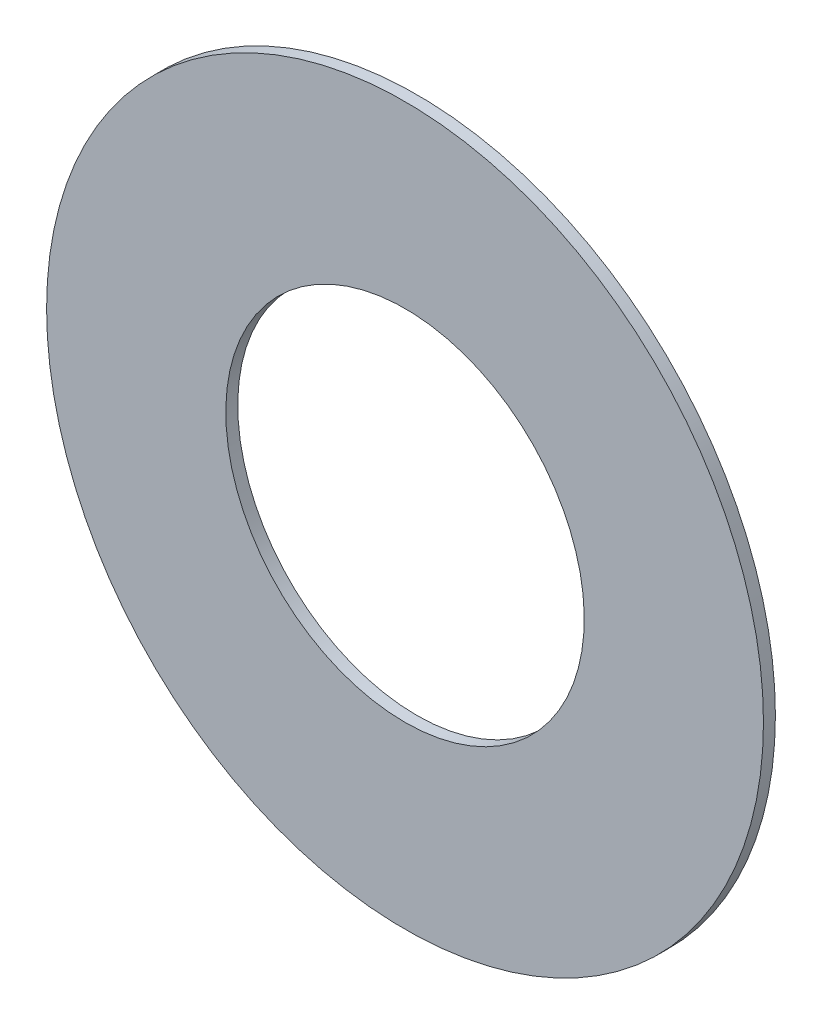
ISO-10303-21;
HEADER;
FILE_DESCRIPTION(('STEP AP214'),'2;1');
FILE_NAME('part.step','',(''),(''),'','','');
FILE_SCHEMA(('AUTOMOTIVE_DESIGN { 1 0 10303 214 1 1 1 1 }'));
ENDSEC;
DATA;
#1=APPLICATION_CONTEXT('core data for automotive mechanical design processes');
#2=APPLICATION_PROTOCOL_DEFINITION('international standard','automotive_design',2000,#1);
#3=PRODUCT_CONTEXT('',#1,'mechanical');
#4=PRODUCT('Part','Part','',(#3));
#5=PRODUCT_RELATED_PRODUCT_CATEGORY('part','',(#4));
#6=PRODUCT_DEFINITION_FORMATION('','',#4);
#7=PRODUCT_DEFINITION_CONTEXT('part definition',#1,'design');
#8=PRODUCT_DEFINITION('design','',#6,#7);
#9=PRODUCT_DEFINITION_SHAPE('','',#8);
#10=(LENGTH_UNIT() NAMED_UNIT(*) SI_UNIT(.MILLI.,.METRE.));
#11=(NAMED_UNIT(*) PLANE_ANGLE_UNIT() SI_UNIT($,.RADIAN.));
#12=(NAMED_UNIT(*) SI_UNIT($,.STERADIAN.) SOLID_ANGLE_UNIT());
#13=UNCERTAINTY_MEASURE_WITH_UNIT(LENGTH_MEASURE(1.E-05),#10,'distance_accuracy_value','');
#14=(GEOMETRIC_REPRESENTATION_CONTEXT(3) GLOBAL_UNCERTAINTY_ASSIGNED_CONTEXT((#13)) GLOBAL_UNIT_ASSIGNED_CONTEXT((#10,
#11,#12)) REPRESENTATION_CONTEXT('',''));
#15=CARTESIAN_POINT('',(0.,0.,0.));
#16=DIRECTION('',(0.,0.,1.));
#17=DIRECTION('',(1.,0.,0.));
#18=AXIS2_PLACEMENT_3D('',#15,#16,#17);
#19=CARTESIAN_POINT('',(126.802,-114.284,-0.045));
#20=DIRECTION('',(0.,0.,-1.));
#21=DIRECTION('',(0.,-1.,0.));
#22=AXIS2_PLACEMENT_3D('',#19,#20,#21);
#23=CYLINDRICAL_SURFACE('',#22,0.525);
#24=CARTESIAN_POINT('',(126.802,-114.284,1.67));
#25=DIRECTION('',(0.,0.,-1.));
#26=DIRECTION('',(0.,-1.,0.));
#27=AXIS2_PLACEMENT_3D('',#24,#25,#26);
#28=CIRCLE('',#27,0.525);
#29=CARTESIAN_POINT('',(126.802,-114.809,1.67));
#30=VERTEX_POINT('',#29);
#31=EDGE_CURVE('E26',#30,#30,#28,.T.);
#32=ORIENTED_EDGE('',*,*,#31,.T.);
#33=DIRECTION('',(0.,0.,1.));
#34=VECTOR('',#33,1.);
#35=CARTESIAN_POINT('',(126.802,-114.809,-0.045));
#36=LINE('',#35,#34);
#37=CARTESIAN_POINT('',(126.802,-114.809,1.705));
#38=VERTEX_POINT('',#37);
#39=EDGE_CURVE('E11',#30,#38,#36,.T.);
#40=ORIENTED_EDGE('',*,*,#39,.T.);
#41=CARTESIAN_POINT('',(126.802,-114.284,1.705));
#42=DIRECTION('',(0.,0.,-1.));
#43=DIRECTION('',(0.,-1.,0.));
#44=AXIS2_PLACEMENT_3D('',#41,#42,#43);
#45=CIRCLE('',#44,0.525);
#46=EDGE_CURVE('E70',#38,#38,#45,.T.);
#47=ORIENTED_EDGE('',*,*,#46,.F.);
#48=ORIENTED_EDGE('',*,*,#39,.F.);
#49=EDGE_LOOP('',(#32,#40,#47,#48));
#50=FACE_BOUND('',#49,.T.);
#51=ADVANCED_FACE('F17',(#50),#23,.F.);
#52=CARTESIAN_POINT('',(126.802,-114.284,1.67));
#53=DIRECTION('',(0.,0.,1.));
#54=DIRECTION('',(1.,0.,0.));
#55=AXIS2_PLACEMENT_3D('',#52,#53,#54);
#56=PLANE('',#55);
#57=ORIENTED_EDGE('',*,*,#31,.F.);
#58=EDGE_LOOP('',(#57));
#59=FACE_BOUND('',#58,.T.);
#60=CARTESIAN_POINT('',(126.802,-114.284,1.67));
#61=DIRECTION('',(0.,0.,1.));
#62=DIRECTION('',(1.,0.,0.));
#63=AXIS2_PLACEMENT_3D('',#60,#61,#62);
#64=CIRCLE('',#63,1.05);
#65=CARTESIAN_POINT('',(127.852,-114.284,1.67));
#66=VERTEX_POINT('',#65);
#67=EDGE_CURVE('E57',#66,#66,#64,.T.);
#68=ORIENTED_EDGE('',*,*,#67,.F.);
#69=EDGE_LOOP('',(#68));
#70=FACE_BOUND('',#69,.T.);
#71=ADVANCED_FACE('F19',(#59,#70),#56,.F.);
#72=CARTESIAN_POINT('',(126.802,-114.284,1.705));
#73=DIRECTION('',(0.,0.,1.));
#74=DIRECTION('',(1.,0.,0.));
#75=AXIS2_PLACEMENT_3D('',#72,#73,#74);
#76=PLANE('',#75);
#77=ORIENTED_EDGE('',*,*,#46,.T.);
#78=EDGE_LOOP('',(#77));
#79=FACE_BOUND('',#78,.T.);
#80=CARTESIAN_POINT('',(126.802,-114.284,1.705));
#81=DIRECTION('',(0.,0.,1.));
#82=DIRECTION('',(1.,0.,0.));
#83=AXIS2_PLACEMENT_3D('',#80,#81,#82);
#84=CIRCLE('',#83,1.05);
#85=CARTESIAN_POINT('',(127.852,-114.284,1.705));
#86=VERTEX_POINT('',#85);
#87=EDGE_CURVE('E55',#86,#86,#84,.T.);
#88=ORIENTED_EDGE('',*,*,#87,.T.);
#89=EDGE_LOOP('',(#88));
#90=FACE_BOUND('',#89,.T.);
#91=ADVANCED_FACE('F61',(#79,#90),#76,.T.);
#92=CARTESIAN_POINT('',(126.802,-114.284,1.67));
#93=DIRECTION('',(0.,0.,1.));
#94=DIRECTION('',(1.,0.,0.));
#95=AXIS2_PLACEMENT_3D('',#92,#93,#94);
#96=CYLINDRICAL_SURFACE('',#95,1.05);
#97=ORIENTED_EDGE('',*,*,#87,.F.);
#98=DIRECTION('',(0.,0.,1.));
#99=VECTOR('',#98,1.);
#100=CARTESIAN_POINT('',(127.852,-114.284,1.67));
#101=LINE('',#100,#99);
#102=EDGE_CURVE('E52',#66,#86,#101,.T.);
#103=ORIENTED_EDGE('',*,*,#102,.F.);
#104=ORIENTED_EDGE('',*,*,#67,.T.);
#105=ORIENTED_EDGE('',*,*,#102,.T.);
#106=EDGE_LOOP('',(#97,#103,#104,#105));
#107=FACE_BOUND('',#106,.T.);
#108=ADVANCED_FACE('F54',(#107),#96,.T.);
#109=CLOSED_SHELL('',(#51,#71,#91,#108));
#110=MANIFOLD_SOLID_BREP('B1',#109);
#111=ADVANCED_BREP_SHAPE_REPRESENTATION('',(#18,#110),#14);
#112=SHAPE_DEFINITION_REPRESENTATION(#9,#111);
ENDSEC;
END-ISO-10303-21;
